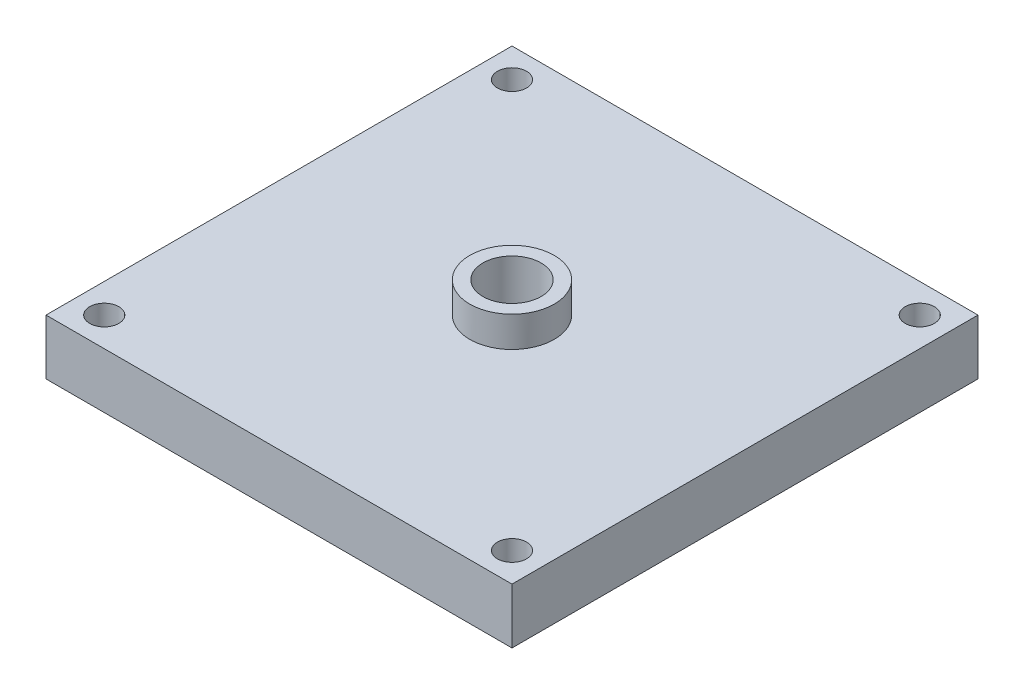
ISO-10303-21;
HEADER;
FILE_DESCRIPTION(('STEP AP214'),'2;1');
FILE_NAME('part.step','',(''),(''),'','','');
FILE_SCHEMA(('AUTOMOTIVE_DESIGN { 1 0 10303 214 1 1 1 1 }'));
ENDSEC;
DATA;
#1=APPLICATION_CONTEXT('core data for automotive mechanical design processes');
#2=APPLICATION_PROTOCOL_DEFINITION('international standard','automotive_design',2000,#1);
#3=PRODUCT_CONTEXT('',#1,'mechanical');
#4=PRODUCT('Part','Part','',(#3));
#5=PRODUCT_RELATED_PRODUCT_CATEGORY('part','',(#4));
#6=PRODUCT_DEFINITION_FORMATION('','',#4);
#7=PRODUCT_DEFINITION_CONTEXT('part definition',#1,'design');
#8=PRODUCT_DEFINITION('design','',#6,#7);
#9=PRODUCT_DEFINITION_SHAPE('','',#8);
#10=(LENGTH_UNIT() NAMED_UNIT(*) SI_UNIT(.MILLI.,.METRE.));
#11=(NAMED_UNIT(*) PLANE_ANGLE_UNIT() SI_UNIT($,.RADIAN.));
#12=(NAMED_UNIT(*) SI_UNIT($,.STERADIAN.) SOLID_ANGLE_UNIT());
#13=UNCERTAINTY_MEASURE_WITH_UNIT(LENGTH_MEASURE(1.E-05),#10,'distance_accuracy_value','');
#14=(GEOMETRIC_REPRESENTATION_CONTEXT(3) GLOBAL_UNCERTAINTY_ASSIGNED_CONTEXT((#13)) GLOBAL_UNIT_ASSIGNED_CONTEXT((#10,
#11,#12)) REPRESENTATION_CONTEXT('',''));
#15=CARTESIAN_POINT('',(0.,0.,0.));
#16=DIRECTION('',(0.,0.,1.));
#17=DIRECTION('',(1.,0.,0.));
#18=AXIS2_PLACEMENT_3D('',#15,#16,#17);
#19=CARTESIAN_POINT('',(0.,9.5,0.));
#20=DIRECTION('',(0.,-1.,0.));
#21=DIRECTION('',(0.,0.,-1.));
#22=AXIS2_PLACEMENT_3D('',#19,#20,#21);
#23=PLANE('',#22);
#24=CARTESIAN_POINT('',(5.,9.5,-5.));
#25=DIRECTION('',(0.,1.,0.));
#26=DIRECTION('',(0.,0.,1.));
#27=AXIS2_PLACEMENT_3D('',#24,#25,#26);
#28=CIRCLE('',#27,2.5);
#29=CARTESIAN_POINT('',(5.,9.5,-2.5));
#30=VERTEX_POINT('',#29);
#31=EDGE_CURVE('E143',#30,#30,#28,.T.);
#32=ORIENTED_EDGE('',*,*,#31,.F.);
#33=EDGE_LOOP('',(#32));
#34=FACE_BOUND('',#33,.T.);
#35=CARTESIAN_POINT('',(75.,9.5,-5.));
#36=DIRECTION('',(0.,1.,0.));
#37=DIRECTION('',(0.,0.,1.));
#38=AXIS2_PLACEMENT_3D('',#35,#36,#37);
#39=CIRCLE('',#38,2.50000000000001);
#40=CARTESIAN_POINT('',(75.,9.5,-2.49999999999999));
#41=VERTEX_POINT('',#40);
#42=EDGE_CURVE('E155',#41,#41,#39,.T.);
#43=ORIENTED_EDGE('',*,*,#42,.F.);
#44=EDGE_LOOP('',(#43));
#45=FACE_BOUND('',#44,.T.);
#46=CARTESIAN_POINT('',(75.,9.5,-75.));
#47=DIRECTION('',(0.,1.,0.));
#48=DIRECTION('',(0.,0.,1.));
#49=AXIS2_PLACEMENT_3D('',#46,#47,#48);
#50=CIRCLE('',#49,2.50000000000001);
#51=CARTESIAN_POINT('',(75.,9.5,-72.5));
#52=VERTEX_POINT('',#51);
#53=EDGE_CURVE('E162',#52,#52,#50,.T.);
#54=ORIENTED_EDGE('',*,*,#53,.F.);
#55=EDGE_LOOP('',(#54));
#56=FACE_BOUND('',#55,.T.);
#57=CARTESIAN_POINT('',(5.,9.5,-75.));
#58=DIRECTION('',(0.,1.,0.));
#59=DIRECTION('',(0.,0.,1.));
#60=AXIS2_PLACEMENT_3D('',#57,#58,#59);
#61=CIRCLE('',#60,2.5);
#62=CARTESIAN_POINT('',(5.,9.5,-72.5));
#63=VERTEX_POINT('',#62);
#64=EDGE_CURVE('E115',#63,#63,#61,.T.);
#65=ORIENTED_EDGE('',*,*,#64,.F.);
#66=EDGE_LOOP('',(#65));
#67=FACE_BOUND('',#66,.T.);
#68=DIRECTION('',(0.,0.,1.));
#69=VECTOR('',#68,1.);
#70=CARTESIAN_POINT('',(0.,9.5,0.));
#71=LINE('',#70,#69);
#72=CARTESIAN_POINT('',(0.,9.5,-80.));
#73=VERTEX_POINT('',#72);
#74=CARTESIAN_POINT('',(0.,9.5,0.));
#75=VERTEX_POINT('',#74);
#76=EDGE_CURVE('E93',#73,#75,#71,.T.);
#77=ORIENTED_EDGE('',*,*,#76,.T.);
#78=DIRECTION('',(1.,0.,0.));
#79=VECTOR('',#78,1.);
#80=CARTESIAN_POINT('',(0.,9.5,0.));
#81=LINE('',#80,#79);
#82=CARTESIAN_POINT('',(80.,9.5,0.));
#83=VERTEX_POINT('',#82);
#84=EDGE_CURVE('E88',#75,#83,#81,.T.);
#85=ORIENTED_EDGE('',*,*,#84,.T.);
#86=DIRECTION('',(0.,0.,-1.));
#87=VECTOR('',#86,1.);
#88=CARTESIAN_POINT('',(80.,9.5,0.));
#89=LINE('',#88,#87);
#90=CARTESIAN_POINT('',(80.,9.5,-80.));
#91=VERTEX_POINT('',#90);
#92=EDGE_CURVE('E91',#83,#91,#89,.T.);
#93=ORIENTED_EDGE('',*,*,#92,.T.);
#94=DIRECTION('',(-1.,0.,0.));
#95=VECTOR('',#94,1.);
#96=CARTESIAN_POINT('',(0.,9.5,-80.));
#97=LINE('',#96,#95);
#98=EDGE_CURVE('E57',#91,#73,#97,.T.);
#99=ORIENTED_EDGE('',*,*,#98,.T.);
#100=EDGE_LOOP('',(#77,#85,#93,#99));
#101=FACE_BOUND('',#100,.T.);
#102=CARTESIAN_POINT('',(40.,9.5,-40.));
#103=DIRECTION('',(0.,-1.,0.));
#104=DIRECTION('',(0.,0.,-1.));
#105=AXIS2_PLACEMENT_3D('',#102,#103,#104);
#106=CIRCLE('',#105,7.25);
#107=CARTESIAN_POINT('',(40.,9.5,-47.25));
#108=VERTEX_POINT('',#107);
#109=EDGE_CURVE('E11',#108,#108,#106,.F.);
#110=ORIENTED_EDGE('',*,*,#109,.F.);
#111=EDGE_LOOP('',(#110));
#112=FACE_BOUND('',#111,.T.);
#113=ADVANCED_FACE('F39',(#34,#45,#56,#67,#101,#112),#23,.F.);
#114=CARTESIAN_POINT('',(0.,0.,0.));
#115=DIRECTION('',(0.,-1.,0.));
#116=DIRECTION('',(0.,0.,-1.));
#117=AXIS2_PLACEMENT_3D('',#114,#115,#116);
#118=PLANE('',#117);
#119=CARTESIAN_POINT('',(75.,0.,-5.));
#120=DIRECTION('',(0.,1.,0.));
#121=DIRECTION('',(0.,0.,1.));
#122=AXIS2_PLACEMENT_3D('',#119,#120,#121);
#123=CIRCLE('',#122,2.50000000000001);
#124=CARTESIAN_POINT('',(75.,0.,-2.49999999999999));
#125=VERTEX_POINT('',#124);
#126=EDGE_CURVE('E149',#125,#125,#123,.T.);
#127=ORIENTED_EDGE('',*,*,#126,.T.);
#128=EDGE_LOOP('',(#127));
#129=FACE_BOUND('',#128,.T.);
#130=CARTESIAN_POINT('',(5.,0.,-75.));
#131=DIRECTION('',(0.,1.,0.));
#132=DIRECTION('',(0.,0.,1.));
#133=AXIS2_PLACEMENT_3D('',#130,#131,#132);
#134=CIRCLE('',#133,2.5);
#135=CARTESIAN_POINT('',(5.,0.,-72.5));
#136=VERTEX_POINT('',#135);
#137=EDGE_CURVE('E166',#136,#136,#134,.T.);
#138=ORIENTED_EDGE('',*,*,#137,.T.);
#139=EDGE_LOOP('',(#138));
#140=FACE_BOUND('',#139,.T.);
#141=DIRECTION('',(0.,0.,1.));
#142=VECTOR('',#141,1.);
#143=CARTESIAN_POINT('',(0.,0.,0.));
#144=LINE('',#143,#142);
#145=CARTESIAN_POINT('',(0.,0.,-80.));
#146=VERTEX_POINT('',#145);
#147=CARTESIAN_POINT('',(0.,0.,0.));
#148=VERTEX_POINT('',#147);
#149=EDGE_CURVE('E111',#146,#148,#144,.T.);
#150=ORIENTED_EDGE('',*,*,#149,.F.);
#151=DIRECTION('',(-1.,0.,0.));
#152=VECTOR('',#151,1.);
#153=CARTESIAN_POINT('',(0.,0.,-80.));
#154=LINE('',#153,#152);
#155=CARTESIAN_POINT('',(80.,0.,-80.));
#156=VERTEX_POINT('',#155);
#157=EDGE_CURVE('E80',#156,#146,#154,.T.);
#158=ORIENTED_EDGE('',*,*,#157,.F.);
#159=DIRECTION('',(0.,0.,-1.));
#160=VECTOR('',#159,1.);
#161=CARTESIAN_POINT('',(80.,0.,0.));
#162=LINE('',#161,#160);
#163=CARTESIAN_POINT('',(80.,0.,0.));
#164=VERTEX_POINT('',#163);
#165=EDGE_CURVE('E74',#164,#156,#162,.T.);
#166=ORIENTED_EDGE('',*,*,#165,.F.);
#167=DIRECTION('',(1.,0.,0.));
#168=VECTOR('',#167,1.);
#169=CARTESIAN_POINT('',(0.,0.,0.));
#170=LINE('',#169,#168);
#171=EDGE_CURVE('E99',#148,#164,#170,.T.);
#172=ORIENTED_EDGE('',*,*,#171,.F.);
#173=EDGE_LOOP('',(#150,#158,#166,#172));
#174=FACE_BOUND('',#173,.T.);
#175=CARTESIAN_POINT('',(75.,0.,-75.));
#176=DIRECTION('',(0.,1.,0.));
#177=DIRECTION('',(0.,0.,1.));
#178=AXIS2_PLACEMENT_3D('',#175,#176,#177);
#179=CIRCLE('',#178,2.50000000000001);
#180=CARTESIAN_POINT('',(75.,0.,-72.5));
#181=VERTEX_POINT('',#180);
#182=EDGE_CURVE('E137',#181,#181,#179,.T.);
#183=ORIENTED_EDGE('',*,*,#182,.T.);
#184=EDGE_LOOP('',(#183));
#185=FACE_BOUND('',#184,.T.);
#186=CARTESIAN_POINT('',(5.,0.,-5.));
#187=DIRECTION('',(0.,1.,0.));
#188=DIRECTION('',(0.,0.,1.));
#189=AXIS2_PLACEMENT_3D('',#186,#187,#188);
#190=CIRCLE('',#189,2.5);
#191=CARTESIAN_POINT('',(5.,0.,-2.5));
#192=VERTEX_POINT('',#191);
#193=EDGE_CURVE('E140',#192,#192,#190,.T.);
#194=ORIENTED_EDGE('',*,*,#193,.T.);
#195=EDGE_LOOP('',(#194));
#196=FACE_BOUND('',#195,.T.);
#197=ADVANCED_FACE('F129',(#129,#140,#174,#185,#196),#118,.T.);
#198=CARTESIAN_POINT('',(0.,9.5,0.));
#199=DIRECTION('',(1.,0.,0.));
#200=DIRECTION('',(0.,0.,-1.));
#201=AXIS2_PLACEMENT_3D('',#198,#199,#200);
#202=PLANE('',#201);
#203=ORIENTED_EDGE('',*,*,#149,.T.);
#204=DIRECTION('',(0.,-1.,0.));
#205=VECTOR('',#204,1.);
#206=CARTESIAN_POINT('',(0.,9.5,0.));
#207=LINE('',#206,#205);
#208=EDGE_CURVE('E49',#75,#148,#207,.T.);
#209=ORIENTED_EDGE('',*,*,#208,.F.);
#210=ORIENTED_EDGE('',*,*,#76,.F.);
#211=DIRECTION('',(0.,-1.,0.));
#212=VECTOR('',#211,1.);
#213=CARTESIAN_POINT('',(0.,9.5,-80.));
#214=LINE('',#213,#212);
#215=EDGE_CURVE('E107',#73,#146,#214,.T.);
#216=ORIENTED_EDGE('',*,*,#215,.T.);
#217=EDGE_LOOP('',(#203,#209,#210,#216));
#218=FACE_BOUND('',#217,.T.);
#219=ADVANCED_FACE('F41',(#218),#202,.F.);
#220=CARTESIAN_POINT('',(0.,9.5,0.));
#221=DIRECTION('',(0.,0.,-1.));
#222=DIRECTION('',(-1.,0.,0.));
#223=AXIS2_PLACEMENT_3D('',#220,#221,#222);
#224=PLANE('',#223);
#225=ORIENTED_EDGE('',*,*,#171,.T.);
#226=DIRECTION('',(0.,-1.,0.));
#227=VECTOR('',#226,1.);
#228=CARTESIAN_POINT('',(80.,9.5,0.));
#229=LINE('',#228,#227);
#230=EDGE_CURVE('E97',#83,#164,#229,.T.);
#231=ORIENTED_EDGE('',*,*,#230,.F.);
#232=ORIENTED_EDGE('',*,*,#84,.F.);
#233=ORIENTED_EDGE('',*,*,#208,.T.);
#234=EDGE_LOOP('',(#225,#231,#232,#233));
#235=FACE_BOUND('',#234,.T.);
#236=ADVANCED_FACE('F98',(#235),#224,.F.);
#237=CARTESIAN_POINT('',(80.,9.5,0.));
#238=DIRECTION('',(-1.,0.,0.));
#239=DIRECTION('',(0.,0.,1.));
#240=AXIS2_PLACEMENT_3D('',#237,#238,#239);
#241=PLANE('',#240);
#242=ORIENTED_EDGE('',*,*,#165,.T.);
#243=DIRECTION('',(0.,-1.,0.));
#244=VECTOR('',#243,1.);
#245=CARTESIAN_POINT('',(80.,9.5,-80.));
#246=LINE('',#245,#244);
#247=EDGE_CURVE('E101',#91,#156,#246,.T.);
#248=ORIENTED_EDGE('',*,*,#247,.F.);
#249=ORIENTED_EDGE('',*,*,#92,.F.);
#250=ORIENTED_EDGE('',*,*,#230,.T.);
#251=EDGE_LOOP('',(#242,#248,#249,#250));
#252=FACE_BOUND('',#251,.T.);
#253=ADVANCED_FACE('F103',(#252),#241,.F.);
#254=CARTESIAN_POINT('',(0.,9.5,-80.));
#255=DIRECTION('',(0.,0.,1.));
#256=DIRECTION('',(1.,0.,0.));
#257=AXIS2_PLACEMENT_3D('',#254,#255,#256);
#258=PLANE('',#257);
#259=ORIENTED_EDGE('',*,*,#157,.T.);
#260=ORIENTED_EDGE('',*,*,#215,.F.);
#261=ORIENTED_EDGE('',*,*,#98,.F.);
#262=ORIENTED_EDGE('',*,*,#247,.T.);
#263=EDGE_LOOP('',(#259,#260,#261,#262));
#264=FACE_BOUND('',#263,.T.);
#265=ADVANCED_FACE('F181',(#264),#258,.F.);
#266=CARTESIAN_POINT('',(5.,9.5,-75.));
#267=DIRECTION('',(0.,-1.,0.));
#268=DIRECTION('',(0.,0.,-1.));
#269=AXIS2_PLACEMENT_3D('',#266,#267,#268);
#270=CYLINDRICAL_SURFACE('',#269,2.5);
#271=ORIENTED_EDGE('',*,*,#64,.T.);
#272=EDGE_LOOP('',(#271));
#273=FACE_BOUND('',#272,.T.);
#274=ORIENTED_EDGE('',*,*,#137,.F.);
#275=EDGE_LOOP('',(#274));
#276=FACE_BOUND('',#275,.T.);
#277=ADVANCED_FACE('F178',(#273,#276),#270,.F.);
#278=CARTESIAN_POINT('',(75.,9.5,-75.));
#279=DIRECTION('',(0.,-1.,0.));
#280=DIRECTION('',(0.,0.,-1.));
#281=AXIS2_PLACEMENT_3D('',#278,#279,#280);
#282=CYLINDRICAL_SURFACE('',#281,2.50000000000001);
#283=ORIENTED_EDGE('',*,*,#53,.T.);
#284=EDGE_LOOP('',(#283));
#285=FACE_BOUND('',#284,.T.);
#286=ORIENTED_EDGE('',*,*,#182,.F.);
#287=EDGE_LOOP('',(#286));
#288=FACE_BOUND('',#287,.T.);
#289=ADVANCED_FACE('F180',(#285,#288),#282,.F.);
#290=CARTESIAN_POINT('',(75.,9.5,-5.));
#291=DIRECTION('',(0.,-1.,0.));
#292=DIRECTION('',(0.,0.,-1.));
#293=AXIS2_PLACEMENT_3D('',#290,#291,#292);
#294=CYLINDRICAL_SURFACE('',#293,2.50000000000001);
#295=ORIENTED_EDGE('',*,*,#42,.T.);
#296=EDGE_LOOP('',(#295));
#297=FACE_BOUND('',#296,.T.);
#298=ORIENTED_EDGE('',*,*,#126,.F.);
#299=EDGE_LOOP('',(#298));
#300=FACE_BOUND('',#299,.T.);
#301=ADVANCED_FACE('F188',(#297,#300),#294,.F.);
#302=CARTESIAN_POINT('',(5.,9.5,-5.));
#303=DIRECTION('',(0.,-1.,0.));
#304=DIRECTION('',(0.,0.,-1.));
#305=AXIS2_PLACEMENT_3D('',#302,#303,#304);
#306=CYLINDRICAL_SURFACE('',#305,2.5);
#307=ORIENTED_EDGE('',*,*,#31,.T.);
#308=EDGE_LOOP('',(#307));
#309=FACE_BOUND('',#308,.T.);
#310=ORIENTED_EDGE('',*,*,#193,.F.);
#311=EDGE_LOOP('',(#310));
#312=FACE_BOUND('',#311,.T.);
#313=ADVANCED_FACE('F246',(#309,#312),#306,.F.);
#314=CARTESIAN_POINT('',(40.,14.75,-40.));
#315=DIRECTION('',(0.,-1.,0.));
#316=DIRECTION('',(0.,0.,-1.));
#317=AXIS2_PLACEMENT_3D('',#314,#315,#316);
#318=CYLINDRICAL_SURFACE('',#317,7.25);
#319=CARTESIAN_POINT('',(40.,14.75,-40.));
#320=DIRECTION('',(0.,1.,0.));
#321=DIRECTION('',(0.,0.,1.));
#322=AXIS2_PLACEMENT_3D('',#319,#320,#321);
#323=CIRCLE('',#322,7.25);
#324=CARTESIAN_POINT('',(40.,14.75,-32.75));
#325=VERTEX_POINT('',#324);
#326=EDGE_CURVE('E152',#325,#325,#323,.T.);
#327=ORIENTED_EDGE('',*,*,#326,.F.);
#328=EDGE_LOOP('',(#327));
#329=FACE_BOUND('',#328,.T.);
#330=ORIENTED_EDGE('',*,*,#109,.T.);
#331=EDGE_LOOP('',(#330));
#332=FACE_BOUND('',#331,.T.);
#333=ADVANCED_FACE('F255',(#329,#332),#318,.T.);
#334=CARTESIAN_POINT('',(40.,14.75,-40.));
#335=DIRECTION('',(0.,1.,0.));
#336=DIRECTION('',(0.,0.,1.));
#337=AXIS2_PLACEMENT_3D('',#334,#335,#336);
#338=PLANE('',#337);
#339=ORIENTED_EDGE('',*,*,#326,.T.);
#340=EDGE_LOOP('',(#339));
#341=FACE_BOUND('',#340,.T.);
#342=CARTESIAN_POINT('',(40.,14.75,-40.));
#343=DIRECTION('',(0.,1.,0.));
#344=DIRECTION('',(0.,0.,1.));
#345=AXIS2_PLACEMENT_3D('',#342,#343,#344);
#346=CIRCLE('',#345,5.);
#347=CARTESIAN_POINT('',(40.,14.75,-35.));
#348=VERTEX_POINT('',#347);
#349=EDGE_CURVE('E312',#348,#348,#346,.T.);
#350=ORIENTED_EDGE('',*,*,#349,.F.);
#351=EDGE_LOOP('',(#350));
#352=FACE_BOUND('',#351,.T.);
#353=ADVANCED_FACE('F277',(#341,#352),#338,.T.);
#354=CARTESIAN_POINT('',(40.,4.75,-40.));
#355=DIRECTION('',(0.,1.,0.));
#356=DIRECTION('',(0.,0.,1.));
#357=AXIS2_PLACEMENT_3D('',#354,#355,#356);
#358=PLANE('',#357);
#359=CARTESIAN_POINT('',(40.,4.75,-40.));
#360=DIRECTION('',(0.,1.,0.));
#361=DIRECTION('',(0.,0.,1.));
#362=AXIS2_PLACEMENT_3D('',#359,#360,#361);
#363=CIRCLE('',#362,5.);
#364=CARTESIAN_POINT('',(40.,4.75,-35.));
#365=VERTEX_POINT('',#364);
#366=EDGE_CURVE('E144',#365,#365,#363,.T.);
#367=ORIENTED_EDGE('',*,*,#366,.T.);
#368=EDGE_LOOP('',(#367));
#369=FACE_BOUND('',#368,.T.);
#370=ADVANCED_FACE('F266',(#369),#358,.T.);
#371=CARTESIAN_POINT('',(40.,4.75,-40.));
#372=DIRECTION('',(0.,1.,0.));
#373=DIRECTION('',(0.,0.,1.));
#374=AXIS2_PLACEMENT_3D('',#371,#372,#373);
#375=CYLINDRICAL_SURFACE('',#374,5.);
#376=ORIENTED_EDGE('',*,*,#366,.F.);
#377=EDGE_LOOP('',(#376));
#378=FACE_BOUND('',#377,.T.);
#379=ORIENTED_EDGE('',*,*,#349,.T.);
#380=EDGE_LOOP('',(#379));
#381=FACE_BOUND('',#380,.T.);
#382=ADVANCED_FACE('F260',(#378,#381),#375,.F.);
#383=CLOSED_SHELL('',(#113,#197,#219,#236,#253,#265,#277,#289,#301,#313,#333,#353,#370,#382));
#384=MANIFOLD_SOLID_BREP('B2',#383);
#385=ADVANCED_BREP_SHAPE_REPRESENTATION('',(#18,#384),#14);
#386=SHAPE_DEFINITION_REPRESENTATION(#9,#385);
ENDSEC;
END-ISO-10303-21;
